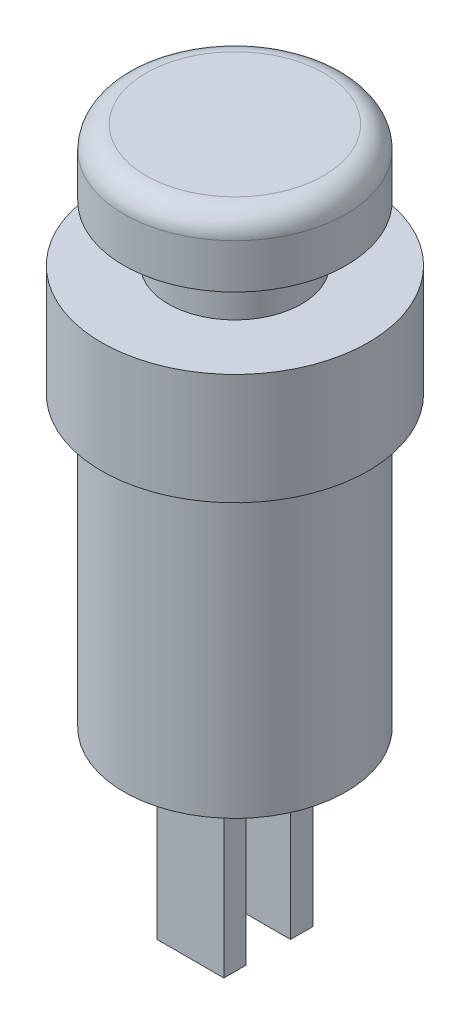
ISO-10303-21;
HEADER;
FILE_DESCRIPTION(('STEP AP214'),'2;1');
FILE_NAME('part.step','',(''),(''),'','','');
FILE_SCHEMA(('AUTOMOTIVE_DESIGN { 1 0 10303 214 1 1 1 1 }'));
ENDSEC;
DATA;
#1=APPLICATION_CONTEXT('core data for automotive mechanical design processes');
#2=APPLICATION_PROTOCOL_DEFINITION('international standard','automotive_design',2000,#1);
#3=PRODUCT_CONTEXT('',#1,'mechanical');
#4=PRODUCT('Part','Part','',(#3));
#5=PRODUCT_RELATED_PRODUCT_CATEGORY('part','',(#4));
#6=PRODUCT_DEFINITION_FORMATION('','',#4);
#7=PRODUCT_DEFINITION_CONTEXT('part definition',#1,'design');
#8=PRODUCT_DEFINITION('design','',#6,#7);
#9=PRODUCT_DEFINITION_SHAPE('','',#8);
#10=(LENGTH_UNIT() NAMED_UNIT(*) SI_UNIT(.MILLI.,.METRE.));
#11=(NAMED_UNIT(*) PLANE_ANGLE_UNIT() SI_UNIT($,.RADIAN.));
#12=(NAMED_UNIT(*) SI_UNIT($,.STERADIAN.) SOLID_ANGLE_UNIT());
#13=UNCERTAINTY_MEASURE_WITH_UNIT(LENGTH_MEASURE(1.E-05),#10,'distance_accuracy_value','');
#14=(GEOMETRIC_REPRESENTATION_CONTEXT(3) GLOBAL_UNCERTAINTY_ASSIGNED_CONTEXT((#13)) GLOBAL_UNIT_ASSIGNED_CONTEXT((#10,
#11,#12)) REPRESENTATION_CONTEXT('',''));
#15=CARTESIAN_POINT('',(0.,0.,0.));
#16=DIRECTION('',(0.,0.,1.));
#17=DIRECTION('',(1.,0.,0.));
#18=AXIS2_PLACEMENT_3D('',#15,#16,#17);
#19=CARTESIAN_POINT('',(0.,0.,0.));
#20=DIRECTION('',(0.,1.,0.));
#21=DIRECTION('',(0.,0.,1.));
#22=AXIS2_PLACEMENT_3D('',#19,#20,#21);
#23=PLANE('',#22);
#24=DIRECTION('',(0.,0.,-1.));
#25=VECTOR('',#24,1.);
#26=CARTESIAN_POINT('',(-1.5,0.,-2.));
#27=LINE('',#26,#25);
#28=CARTESIAN_POINT('',(-1.5,0.,-1.));
#29=VERTEX_POINT('',#28);
#30=CARTESIAN_POINT('',(-1.5,0.,-2.));
#31=VERTEX_POINT('',#30);
#32=EDGE_CURVE('E117',#29,#31,#27,.T.);
#33=ORIENTED_EDGE('',*,*,#32,.F.);
#34=DIRECTION('',(-1.,0.,0.));
#35=VECTOR('',#34,1.);
#36=CARTESIAN_POINT('',(-1.5,0.,-1.));
#37=LINE('',#36,#35);
#38=CARTESIAN_POINT('',(1.5,0.,-1.));
#39=VERTEX_POINT('',#38);
#40=EDGE_CURVE('E130',#39,#29,#37,.T.);
#41=ORIENTED_EDGE('',*,*,#40,.F.);
#42=DIRECTION('',(0.,0.,1.));
#43=VECTOR('',#42,1.);
#44=CARTESIAN_POINT('',(1.5,0.,-2.));
#45=LINE('',#44,#43);
#46=CARTESIAN_POINT('',(1.5,0.,-2.));
#47=VERTEX_POINT('',#46);
#48=EDGE_CURVE('E139',#47,#39,#45,.T.);
#49=ORIENTED_EDGE('',*,*,#48,.F.);
#50=DIRECTION('',(1.,0.,0.));
#51=VECTOR('',#50,1.);
#52=CARTESIAN_POINT('',(-1.5,0.,-2.));
#53=LINE('',#52,#51);
#54=EDGE_CURVE('E120',#31,#47,#53,.T.);
#55=ORIENTED_EDGE('',*,*,#54,.F.);
#56=EDGE_LOOP('',(#33,#41,#49,#55));
#57=FACE_BOUND('',#56,.T.);
#58=CARTESIAN_POINT('',(0.,0.,0.));
#59=DIRECTION('',(0.,-1.,0.));
#60=DIRECTION('',(0.,0.,-1.));
#61=AXIS2_PLACEMENT_3D('',#58,#59,#60);
#62=CIRCLE('',#61,5.);
#63=CARTESIAN_POINT('',(0.,0.,-5.));
#64=VERTEX_POINT('',#63);
#65=EDGE_CURVE('E11',#64,#64,#62,.T.);
#66=ORIENTED_EDGE('',*,*,#65,.T.);
#67=EDGE_LOOP('',(#66));
#68=FACE_BOUND('',#67,.T.);
#69=DIRECTION('',(0.,0.,-1.));
#70=VECTOR('',#69,1.);
#71=CARTESIAN_POINT('',(-1.5,0.,1.));
#72=LINE('',#71,#70);
#73=CARTESIAN_POINT('',(-1.5,0.,2.));
#74=VERTEX_POINT('',#73);
#75=CARTESIAN_POINT('',(-1.5,0.,1.));
#76=VERTEX_POINT('',#75);
#77=EDGE_CURVE('E116',#74,#76,#72,.T.);
#78=ORIENTED_EDGE('',*,*,#77,.F.);
#79=DIRECTION('',(-1.,0.,0.));
#80=VECTOR('',#79,1.);
#81=CARTESIAN_POINT('',(-1.5,0.,2.));
#82=LINE('',#81,#80);
#83=CARTESIAN_POINT('',(1.5,0.,2.));
#84=VERTEX_POINT('',#83);
#85=EDGE_CURVE('E113',#84,#74,#82,.T.);
#86=ORIENTED_EDGE('',*,*,#85,.F.);
#87=DIRECTION('',(0.,0.,1.));
#88=VECTOR('',#87,1.);
#89=CARTESIAN_POINT('',(1.5,0.,1.));
#90=LINE('',#89,#88);
#91=CARTESIAN_POINT('',(1.5,0.,1.));
#92=VERTEX_POINT('',#91);
#93=EDGE_CURVE('E51',#92,#84,#90,.T.);
#94=ORIENTED_EDGE('',*,*,#93,.F.);
#95=DIRECTION('',(1.,0.,0.));
#96=VECTOR('',#95,1.);
#97=CARTESIAN_POINT('',(-1.5,0.,1.));
#98=LINE('',#97,#96);
#99=EDGE_CURVE('E46',#76,#92,#98,.T.);
#100=ORIENTED_EDGE('',*,*,#99,.F.);
#101=EDGE_LOOP('',(#78,#86,#94,#100));
#102=FACE_BOUND('',#101,.T.);
#103=ADVANCED_FACE('F32',(#57,#68,#102),#23,.F.);
#104=CARTESIAN_POINT('',(0.,0.,0.));
#105=DIRECTION('',(0.,-1.,0.));
#106=DIRECTION('',(0.,0.,-1.));
#107=AXIS2_PLACEMENT_3D('',#104,#105,#106);
#108=CYLINDRICAL_SURFACE('',#107,5.);
#109=ORIENTED_EDGE('',*,*,#65,.F.);
#110=EDGE_LOOP('',(#109));
#111=FACE_BOUND('',#110,.T.);
#112=CARTESIAN_POINT('',(0.,13.,0.));
#113=DIRECTION('',(0.,-1.,0.));
#114=DIRECTION('',(0.,0.,-1.));
#115=AXIS2_PLACEMENT_3D('',#112,#113,#114);
#116=CIRCLE('',#115,5.);
#117=CARTESIAN_POINT('',(0.,13.,-5.));
#118=VERTEX_POINT('',#117);
#119=EDGE_CURVE('E39',#118,#118,#116,.T.);
#120=ORIENTED_EDGE('',*,*,#119,.T.);
#121=EDGE_LOOP('',(#120));
#122=FACE_BOUND('',#121,.T.);
#123=ADVANCED_FACE('F178',(#111,#122),#108,.T.);
#124=CARTESIAN_POINT('',(-5.,13.,0.));
#125=DIRECTION('',(0.,1.,0.));
#126=DIRECTION('',(0.,0.,1.));
#127=AXIS2_PLACEMENT_3D('',#124,#125,#126);
#128=PLANE('',#127);
#129=ORIENTED_EDGE('',*,*,#119,.F.);
#130=EDGE_LOOP('',(#129));
#131=FACE_BOUND('',#130,.T.);
#132=CARTESIAN_POINT('',(0.,13.,0.));
#133=DIRECTION('',(0.,-1.,0.));
#134=DIRECTION('',(0.,0.,-1.));
#135=AXIS2_PLACEMENT_3D('',#132,#133,#134);
#136=CIRCLE('',#135,6.);
#137=CARTESIAN_POINT('',(0.,13.,-6.));
#138=VERTEX_POINT('',#137);
#139=EDGE_CURVE('E173',#138,#138,#136,.T.);
#140=ORIENTED_EDGE('',*,*,#139,.T.);
#141=EDGE_LOOP('',(#140));
#142=FACE_BOUND('',#141,.T.);
#143=ADVANCED_FACE('F180',(#131,#142),#128,.F.);
#144=CARTESIAN_POINT('',(0.,0.,0.));
#145=DIRECTION('',(0.,-1.,0.));
#146=DIRECTION('',(0.,0.,-1.));
#147=AXIS2_PLACEMENT_3D('',#144,#145,#146);
#148=CYLINDRICAL_SURFACE('',#147,6.);
#149=ORIENTED_EDGE('',*,*,#139,.F.);
#150=EDGE_LOOP('',(#149));
#151=FACE_BOUND('',#150,.T.);
#152=CARTESIAN_POINT('',(0.,18.,0.));
#153=DIRECTION('',(0.,-1.,0.));
#154=DIRECTION('',(0.,0.,-1.));
#155=AXIS2_PLACEMENT_3D('',#152,#153,#154);
#156=CIRCLE('',#155,6.);
#157=CARTESIAN_POINT('',(0.,18.,-6.));
#158=VERTEX_POINT('',#157);
#159=EDGE_CURVE('E170',#158,#158,#156,.T.);
#160=ORIENTED_EDGE('',*,*,#159,.T.);
#161=EDGE_LOOP('',(#160));
#162=FACE_BOUND('',#161,.T.);
#163=ADVANCED_FACE('F183',(#151,#162),#148,.T.);
#164=CARTESIAN_POINT('',(-6.,18.,0.));
#165=DIRECTION('',(0.,-1.,0.));
#166=DIRECTION('',(0.,0.,-1.));
#167=AXIS2_PLACEMENT_3D('',#164,#165,#166);
#168=PLANE('',#167);
#169=ORIENTED_EDGE('',*,*,#159,.F.);
#170=EDGE_LOOP('',(#169));
#171=FACE_BOUND('',#170,.T.);
#172=CARTESIAN_POINT('',(0.,18.,0.));
#173=DIRECTION('',(0.,-1.,0.));
#174=DIRECTION('',(0.,0.,-1.));
#175=AXIS2_PLACEMENT_3D('',#172,#173,#174);
#176=CIRCLE('',#175,3.);
#177=CARTESIAN_POINT('',(0.,18.,-3.));
#178=VERTEX_POINT('',#177);
#179=EDGE_CURVE('E167',#178,#178,#176,.T.);
#180=ORIENTED_EDGE('',*,*,#179,.T.);
#181=EDGE_LOOP('',(#180));
#182=FACE_BOUND('',#181,.T.);
#183=ADVANCED_FACE('F189',(#171,#182),#168,.F.);
#184=CARTESIAN_POINT('',(0.,0.,0.));
#185=DIRECTION('',(0.,-1.,0.));
#186=DIRECTION('',(0.,0.,-1.));
#187=AXIS2_PLACEMENT_3D('',#184,#185,#186);
#188=CYLINDRICAL_SURFACE('',#187,3.);
#189=ORIENTED_EDGE('',*,*,#179,.F.);
#190=EDGE_LOOP('',(#189));
#191=FACE_BOUND('',#190,.T.);
#192=CARTESIAN_POINT('',(0.,20.5,0.));
#193=DIRECTION('',(0.,1.,0.));
#194=DIRECTION('',(0.,0.,1.));
#195=AXIS2_PLACEMENT_3D('',#192,#193,#194);
#196=CIRCLE('',#195,3.);
#197=CARTESIAN_POINT('',(0.,20.5,3.));
#198=VERTEX_POINT('',#197);
#199=EDGE_CURVE('E164',#198,#198,#196,.T.);
#200=ORIENTED_EDGE('',*,*,#199,.F.);
#201=EDGE_LOOP('',(#200));
#202=FACE_BOUND('',#201,.T.);
#203=ADVANCED_FACE('F195',(#191,#202),#188,.T.);
#204=CARTESIAN_POINT('',(-4.,23.5,0.));
#205=DIRECTION('',(0.,-1.,0.));
#206=DIRECTION('',(0.,0.,-1.));
#207=AXIS2_PLACEMENT_3D('',#204,#205,#206);
#208=PLANE('',#207);
#209=CARTESIAN_POINT('',(0.,23.5,0.));
#210=DIRECTION('',(0.,-1.,0.));
#211=DIRECTION('',(0.,0.,-1.));
#212=AXIS2_PLACEMENT_3D('',#209,#210,#211);
#213=CIRCLE('',#212,4.);
#214=CARTESIAN_POINT('',(0.,23.5,-4.));
#215=VERTEX_POINT('',#214);
#216=EDGE_CURVE('E161',#215,#215,#213,.T.);
#217=ORIENTED_EDGE('',*,*,#216,.F.);
#218=EDGE_LOOP('',(#217));
#219=FACE_BOUND('',#218,.T.);
#220=ADVANCED_FACE('F201',(#219),#208,.F.);
#221=CARTESIAN_POINT('',(0.,22.5,0.));
#222=DIRECTION('',(0.,-1.,0.));
#223=DIRECTION('',(0.,0.,-1.));
#224=AXIS2_PLACEMENT_3D('',#221,#222,#223);
#225=TOROIDAL_SURFACE('',#224,4.,1.);
#226=CARTESIAN_POINT('',(0.,22.5,0.));
#227=DIRECTION('',(0.,-1.,0.));
#228=DIRECTION('',(0.,0.,-1.));
#229=AXIS2_PLACEMENT_3D('',#226,#227,#228);
#230=CIRCLE('',#229,5.);
#231=CARTESIAN_POINT('',(0.,22.5,-5.));
#232=VERTEX_POINT('',#231);
#233=EDGE_CURVE('E158',#232,#232,#230,.T.);
#234=ORIENTED_EDGE('',*,*,#233,.F.);
#235=EDGE_LOOP('',(#234));
#236=FACE_BOUND('',#235,.T.);
#237=ORIENTED_EDGE('',*,*,#216,.T.);
#238=EDGE_LOOP('',(#237));
#239=FACE_BOUND('',#238,.T.);
#240=ADVANCED_FACE('F215',(#236,#239),#225,.T.);
#241=CARTESIAN_POINT('',(0.,20.5,0.));
#242=DIRECTION('',(0.,-1.,0.));
#243=DIRECTION('',(0.,0.,-1.));
#244=AXIS2_PLACEMENT_3D('',#241,#242,#243);
#245=CYLINDRICAL_SURFACE('',#244,5.);
#246=CARTESIAN_POINT('',(0.,20.5,0.));
#247=DIRECTION('',(0.,-1.,0.));
#248=DIRECTION('',(0.,0.,-1.));
#249=AXIS2_PLACEMENT_3D('',#246,#247,#248);
#250=CIRCLE('',#249,5.);
#251=CARTESIAN_POINT('',(0.,20.5,-5.));
#252=VERTEX_POINT('',#251);
#253=EDGE_CURVE('E155',#252,#252,#250,.T.);
#254=ORIENTED_EDGE('',*,*,#253,.F.);
#255=EDGE_LOOP('',(#254));
#256=FACE_BOUND('',#255,.T.);
#257=ORIENTED_EDGE('',*,*,#233,.T.);
#258=EDGE_LOOP('',(#257));
#259=FACE_BOUND('',#258,.T.);
#260=ADVANCED_FACE('F209',(#256,#259),#245,.T.);
#261=CARTESIAN_POINT('',(0.,20.5,0.));
#262=DIRECTION('',(0.,1.,0.));
#263=DIRECTION('',(0.,0.,1.));
#264=AXIS2_PLACEMENT_3D('',#261,#262,#263);
#265=PLANE('',#264);
#266=ORIENTED_EDGE('',*,*,#199,.T.);
#267=EDGE_LOOP('',(#266));
#268=FACE_BOUND('',#267,.T.);
#269=ORIENTED_EDGE('',*,*,#253,.T.);
#270=EDGE_LOOP('',(#269));
#271=FACE_BOUND('',#270,.T.);
#272=ADVANCED_FACE('F205',(#268,#271),#265,.F.);
#273=CARTESIAN_POINT('',(-1.5,-8.,-2.));
#274=DIRECTION('',(1.,0.,0.));
#275=DIRECTION('',(0.,0.,-1.));
#276=AXIS2_PLACEMENT_3D('',#273,#274,#275);
#277=PLANE('',#276);
#278=ORIENTED_EDGE('',*,*,#32,.T.);
#279=DIRECTION('',(0.,1.,0.));
#280=VECTOR('',#279,1.);
#281=CARTESIAN_POINT('',(-1.5,-8.,-2.));
#282=LINE('',#281,#280);
#283=CARTESIAN_POINT('',(-1.5,-8.,-2.));
#284=VERTEX_POINT('',#283);
#285=EDGE_CURVE('E152',#284,#31,#282,.T.);
#286=ORIENTED_EDGE('',*,*,#285,.F.);
#287=DIRECTION('',(0.,0.,-1.));
#288=VECTOR('',#287,1.);
#289=CARTESIAN_POINT('',(-1.5,-8.,-2.));
#290=LINE('',#289,#288);
#291=CARTESIAN_POINT('',(-1.5,-8.,-1.));
#292=VERTEX_POINT('',#291);
#293=EDGE_CURVE('E126',#292,#284,#290,.T.);
#294=ORIENTED_EDGE('',*,*,#293,.F.);
#295=DIRECTION('',(0.,1.,0.));
#296=VECTOR('',#295,1.);
#297=CARTESIAN_POINT('',(-1.5,-8.,-1.));
#298=LINE('',#297,#296);
#299=EDGE_CURVE('E135',#292,#29,#298,.T.);
#300=ORIENTED_EDGE('',*,*,#299,.T.);
#301=EDGE_LOOP('',(#278,#286,#294,#300));
#302=FACE_BOUND('',#301,.T.);
#303=ADVANCED_FACE('F208',(#302),#277,.F.);
#304=CARTESIAN_POINT('',(-1.5,-8.,-2.));
#305=DIRECTION('',(0.,0.,1.));
#306=DIRECTION('',(1.,0.,0.));
#307=AXIS2_PLACEMENT_3D('',#304,#305,#306);
#308=PLANE('',#307);
#309=ORIENTED_EDGE('',*,*,#54,.T.);
#310=DIRECTION('',(0.,1.,0.));
#311=VECTOR('',#310,1.);
#312=CARTESIAN_POINT('',(1.5,-8.,-2.));
#313=LINE('',#312,#311);
#314=CARTESIAN_POINT('',(1.5,-8.,-2.));
#315=VERTEX_POINT('',#314);
#316=EDGE_CURVE('E149',#315,#47,#313,.T.);
#317=ORIENTED_EDGE('',*,*,#316,.F.);
#318=DIRECTION('',(1.,0.,0.));
#319=VECTOR('',#318,1.);
#320=CARTESIAN_POINT('',(-1.5,-8.,-2.));
#321=LINE('',#320,#319);
#322=EDGE_CURVE('E129',#284,#315,#321,.T.);
#323=ORIENTED_EDGE('',*,*,#322,.F.);
#324=ORIENTED_EDGE('',*,*,#285,.T.);
#325=EDGE_LOOP('',(#309,#317,#323,#324));
#326=FACE_BOUND('',#325,.T.);
#327=ADVANCED_FACE('F274',(#326),#308,.F.);
#328=CARTESIAN_POINT('',(1.5,-8.,-2.));
#329=DIRECTION('',(-1.,0.,0.));
#330=DIRECTION('',(0.,0.,1.));
#331=AXIS2_PLACEMENT_3D('',#328,#329,#330);
#332=PLANE('',#331);
#333=ORIENTED_EDGE('',*,*,#48,.T.);
#334=DIRECTION('',(0.,1.,0.));
#335=VECTOR('',#334,1.);
#336=CARTESIAN_POINT('',(1.5,-8.,-1.));
#337=LINE('',#336,#335);
#338=CARTESIAN_POINT('',(1.5,-8.,-1.));
#339=VERTEX_POINT('',#338);
#340=EDGE_CURVE('E146',#339,#39,#337,.T.);
#341=ORIENTED_EDGE('',*,*,#340,.F.);
#342=DIRECTION('',(0.,0.,1.));
#343=VECTOR('',#342,1.);
#344=CARTESIAN_POINT('',(1.5,-8.,-2.));
#345=LINE('',#344,#343);
#346=EDGE_CURVE('E132',#315,#339,#345,.T.);
#347=ORIENTED_EDGE('',*,*,#346,.F.);
#348=ORIENTED_EDGE('',*,*,#316,.T.);
#349=EDGE_LOOP('',(#333,#341,#347,#348));
#350=FACE_BOUND('',#349,.T.);
#351=ADVANCED_FACE('F270',(#350),#332,.F.);
#352=CARTESIAN_POINT('',(-1.5,-8.,-1.));
#353=DIRECTION('',(0.,0.,-1.));
#354=DIRECTION('',(-1.,0.,0.));
#355=AXIS2_PLACEMENT_3D('',#352,#353,#354);
#356=PLANE('',#355);
#357=ORIENTED_EDGE('',*,*,#40,.T.);
#358=ORIENTED_EDGE('',*,*,#299,.F.);
#359=DIRECTION('',(-1.,0.,0.));
#360=VECTOR('',#359,1.);
#361=CARTESIAN_POINT('',(-1.5,-8.,-1.));
#362=LINE('',#361,#360);
#363=EDGE_CURVE('E134',#339,#292,#362,.T.);
#364=ORIENTED_EDGE('',*,*,#363,.F.);
#365=ORIENTED_EDGE('',*,*,#340,.T.);
#366=EDGE_LOOP('',(#357,#358,#364,#365));
#367=FACE_BOUND('',#366,.T.);
#368=ADVANCED_FACE('F266',(#367),#356,.F.);
#369=CARTESIAN_POINT('',(0.,-8.,0.));
#370=DIRECTION('',(0.,1.,0.));
#371=DIRECTION('',(0.,0.,1.));
#372=AXIS2_PLACEMENT_3D('',#369,#370,#371);
#373=PLANE('',#372);
#374=ORIENTED_EDGE('',*,*,#293,.T.);
#375=ORIENTED_EDGE('',*,*,#322,.T.);
#376=ORIENTED_EDGE('',*,*,#346,.T.);
#377=ORIENTED_EDGE('',*,*,#363,.T.);
#378=EDGE_LOOP('',(#374,#375,#376,#377));
#379=FACE_BOUND('',#378,.T.);
#380=ADVANCED_FACE('F263',(#379),#373,.F.);
#381=CARTESIAN_POINT('',(-1.5,-8.,1.));
#382=DIRECTION('',(1.,0.,0.));
#383=DIRECTION('',(0.,0.,-1.));
#384=AXIS2_PLACEMENT_3D('',#381,#382,#383);
#385=PLANE('',#384);
#386=ORIENTED_EDGE('',*,*,#77,.T.);
#387=DIRECTION('',(0.,1.,0.));
#388=VECTOR('',#387,1.);
#389=CARTESIAN_POINT('',(-1.5,-8.,1.));
#390=LINE('',#389,#388);
#391=CARTESIAN_POINT('',(-1.5,-8.,1.));
#392=VERTEX_POINT('',#391);
#393=EDGE_CURVE('E97',#392,#76,#390,.T.);
#394=ORIENTED_EDGE('',*,*,#393,.F.);
#395=DIRECTION('',(0.,0.,-1.));
#396=VECTOR('',#395,1.);
#397=CARTESIAN_POINT('',(-1.5,-8.,1.));
#398=LINE('',#397,#396);
#399=CARTESIAN_POINT('',(-1.5,-8.,2.));
#400=VERTEX_POINT('',#399);
#401=EDGE_CURVE('E104',#400,#392,#398,.T.);
#402=ORIENTED_EDGE('',*,*,#401,.F.);
#403=DIRECTION('',(0.,1.,0.));
#404=VECTOR('',#403,1.);
#405=CARTESIAN_POINT('',(-1.5,-8.,2.));
#406=LINE('',#405,#404);
#407=EDGE_CURVE('E241',#400,#74,#406,.T.);
#408=ORIENTED_EDGE('',*,*,#407,.T.);
#409=EDGE_LOOP('',(#386,#394,#402,#408));
#410=FACE_BOUND('',#409,.T.);
#411=ADVANCED_FACE('F115',(#410),#385,.F.);
#412=CARTESIAN_POINT('',(-1.5,-8.,1.));
#413=DIRECTION('',(0.,0.,1.));
#414=DIRECTION('',(1.,0.,0.));
#415=AXIS2_PLACEMENT_3D('',#412,#413,#414);
#416=PLANE('',#415);
#417=ORIENTED_EDGE('',*,*,#99,.T.);
#418=DIRECTION('',(0.,1.,0.));
#419=VECTOR('',#418,1.);
#420=CARTESIAN_POINT('',(1.5,-8.,1.));
#421=LINE('',#420,#419);
#422=CARTESIAN_POINT('',(1.5,-8.,1.));
#423=VERTEX_POINT('',#422);
#424=EDGE_CURVE('E100',#423,#92,#421,.T.);
#425=ORIENTED_EDGE('',*,*,#424,.F.);
#426=DIRECTION('',(1.,0.,0.));
#427=VECTOR('',#426,1.);
#428=CARTESIAN_POINT('',(-1.5,-8.,1.));
#429=LINE('',#428,#427);
#430=EDGE_CURVE('E93',#392,#423,#429,.T.);
#431=ORIENTED_EDGE('',*,*,#430,.F.);
#432=ORIENTED_EDGE('',*,*,#393,.T.);
#433=EDGE_LOOP('',(#417,#425,#431,#432));
#434=FACE_BOUND('',#433,.T.);
#435=ADVANCED_FACE('F95',(#434),#416,.F.);
#436=CARTESIAN_POINT('',(1.5,-8.,1.));
#437=DIRECTION('',(-1.,0.,0.));
#438=DIRECTION('',(0.,0.,1.));
#439=AXIS2_PLACEMENT_3D('',#436,#437,#438);
#440=PLANE('',#439);
#441=ORIENTED_EDGE('',*,*,#93,.T.);
#442=DIRECTION('',(0.,1.,0.));
#443=VECTOR('',#442,1.);
#444=CARTESIAN_POINT('',(1.5,-8.,2.));
#445=LINE('',#444,#443);
#446=CARTESIAN_POINT('',(1.5,-8.,2.));
#447=VERTEX_POINT('',#446);
#448=EDGE_CURVE('E122',#447,#84,#445,.T.);
#449=ORIENTED_EDGE('',*,*,#448,.F.);
#450=DIRECTION('',(0.,0.,1.));
#451=VECTOR('',#450,1.);
#452=CARTESIAN_POINT('',(1.5,-8.,1.));
#453=LINE('',#452,#451);
#454=EDGE_CURVE('E103',#423,#447,#453,.T.);
#455=ORIENTED_EDGE('',*,*,#454,.F.);
#456=ORIENTED_EDGE('',*,*,#424,.T.);
#457=EDGE_LOOP('',(#441,#449,#455,#456));
#458=FACE_BOUND('',#457,.T.);
#459=ADVANCED_FACE('F250',(#458),#440,.F.);
#460=CARTESIAN_POINT('',(-1.5,-8.,2.));
#461=DIRECTION('',(0.,0.,-1.));
#462=DIRECTION('',(-1.,0.,0.));
#463=AXIS2_PLACEMENT_3D('',#460,#461,#462);
#464=PLANE('',#463);
#465=ORIENTED_EDGE('',*,*,#85,.T.);
#466=ORIENTED_EDGE('',*,*,#407,.F.);
#467=DIRECTION('',(-1.,0.,0.));
#468=VECTOR('',#467,1.);
#469=CARTESIAN_POINT('',(-1.5,-8.,2.));
#470=LINE('',#469,#468);
#471=EDGE_CURVE('E109',#447,#400,#470,.T.);
#472=ORIENTED_EDGE('',*,*,#471,.F.);
#473=ORIENTED_EDGE('',*,*,#448,.T.);
#474=EDGE_LOOP('',(#465,#466,#472,#473));
#475=FACE_BOUND('',#474,.T.);
#476=ADVANCED_FACE('F240',(#475),#464,.F.);
#477=CARTESIAN_POINT('',(0.,-8.,0.));
#478=DIRECTION('',(0.,1.,0.));
#479=DIRECTION('',(0.,0.,1.));
#480=AXIS2_PLACEMENT_3D('',#477,#478,#479);
#481=PLANE('',#480);
#482=ORIENTED_EDGE('',*,*,#401,.T.);
#483=ORIENTED_EDGE('',*,*,#430,.T.);
#484=ORIENTED_EDGE('',*,*,#454,.T.);
#485=ORIENTED_EDGE('',*,*,#471,.T.);
#486=EDGE_LOOP('',(#482,#483,#484,#485));
#487=FACE_BOUND('',#486,.T.);
#488=ADVANCED_FACE('F107',(#487),#481,.F.);
#489=CLOSED_SHELL('',(#103,#123,#143,#163,#183,#203,#220,#240,#260,#272,#303,#327,#351,#368,
#380,#411,#435,#459,#476,#488));
#490=MANIFOLD_SOLID_BREP('B2',#489);
#491=ADVANCED_BREP_SHAPE_REPRESENTATION('',(#18,#490),#14);
#492=SHAPE_DEFINITION_REPRESENTATION(#9,#491);
ENDSEC;
END-ISO-10303-21;
